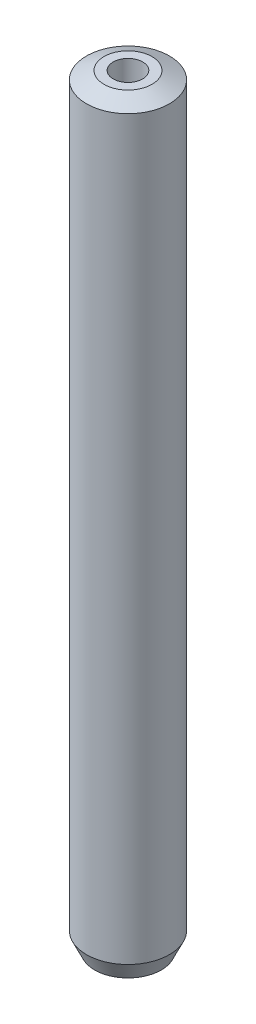
ISO-10303-21;
HEADER;
FILE_DESCRIPTION(('STEP AP214'),'2;1');
FILE_NAME('part.step','',(''),(''),'','','');
FILE_SCHEMA(('AUTOMOTIVE_DESIGN { 1 0 10303 214 1 1 1 1 }'));
ENDSEC;
DATA;
#1=APPLICATION_CONTEXT('core data for automotive mechanical design processes');
#2=APPLICATION_PROTOCOL_DEFINITION('international standard','automotive_design',2000,#1);
#3=PRODUCT_CONTEXT('',#1,'mechanical');
#4=PRODUCT('Part','Part','',(#3));
#5=PRODUCT_RELATED_PRODUCT_CATEGORY('part','',(#4));
#6=PRODUCT_DEFINITION_FORMATION('','',#4);
#7=PRODUCT_DEFINITION_CONTEXT('part definition',#1,'design');
#8=PRODUCT_DEFINITION('design','',#6,#7);
#9=PRODUCT_DEFINITION_SHAPE('','',#8);
#10=(LENGTH_UNIT() NAMED_UNIT(*) SI_UNIT(.MILLI.,.METRE.));
#11=(NAMED_UNIT(*) PLANE_ANGLE_UNIT() SI_UNIT($,.RADIAN.));
#12=(NAMED_UNIT(*) SI_UNIT($,.STERADIAN.) SOLID_ANGLE_UNIT());
#13=UNCERTAINTY_MEASURE_WITH_UNIT(LENGTH_MEASURE(1.E-05),#10,'distance_accuracy_value','');
#14=(GEOMETRIC_REPRESENTATION_CONTEXT(3) GLOBAL_UNCERTAINTY_ASSIGNED_CONTEXT((#13)) GLOBAL_UNIT_ASSIGNED_CONTEXT((#10,
#11,#12)) REPRESENTATION_CONTEXT('',''));
#15=CARTESIAN_POINT('',(0.,0.,0.));
#16=DIRECTION('',(0.,0.,1.));
#17=DIRECTION('',(1.,0.,0.));
#18=AXIS2_PLACEMENT_3D('',#15,#16,#17);
#19=CARTESIAN_POINT('',(0.,137.877778649111,0.));
#20=DIRECTION('',(0.,-1.,0.));
#21=DIRECTION('',(0.,0.,-1.));
#22=AXIS2_PLACEMENT_3D('',#19,#20,#21);
#23=CYLINDRICAL_SURFACE('',#22,7.5);
#24=CARTESIAN_POINT('',(0.,136.40398296129,0.));
#25=DIRECTION('',(0.,1.,0.));
#26=DIRECTION('',(0.,0.,1.));
#27=AXIS2_PLACEMENT_3D('',#24,#25,#26);
#28=CIRCLE('',#27,7.5);
#29=CARTESIAN_POINT('',(0.,136.40398296129,7.5));
#30=VERTEX_POINT('',#29);
#31=EDGE_CURVE('E50',#30,#30,#28,.F.);
#32=ORIENTED_EDGE('',*,*,#31,.T.);
#33=EDGE_LOOP('',(#32));
#34=FACE_BOUND('',#33,.T.);
#35=CARTESIAN_POINT('',(0.,3.15283699319915,0.));
#36=DIRECTION('',(0.,1.,0.));
#37=DIRECTION('',(0.,0.,1.));
#38=AXIS2_PLACEMENT_3D('',#35,#36,#37);
#39=CIRCLE('',#38,7.5);
#40=CARTESIAN_POINT('',(0.,3.15283699319915,7.5));
#41=VERTEX_POINT('',#40);
#42=EDGE_CURVE('E51',#41,#41,#39,.T.);
#43=ORIENTED_EDGE('',*,*,#42,.T.);
#44=EDGE_LOOP('',(#43));
#45=FACE_BOUND('',#44,.T.);
#46=ADVANCED_FACE('F39',(#34,#45),#23,.T.);
#47=CARTESIAN_POINT('',(0.,137.877778649111,0.));
#48=DIRECTION('',(0.,1.,0.));
#49=DIRECTION('',(0.,0.,1.));
#50=AXIS2_PLACEMENT_3D('',#47,#48,#49);
#51=PLANE('',#50);
#52=CARTESIAN_POINT('',(0.,137.877778649111,0.));
#53=DIRECTION('',(0.,1.,0.));
#54=DIRECTION('',(0.,0.,1.));
#55=AXIS2_PLACEMENT_3D('',#52,#53,#54);
#56=CIRCLE('',#55,4.34716300680077);
#57=CARTESIAN_POINT('',(0.,137.877778649111,4.34716300680077));
#58=VERTEX_POINT('',#57);
#59=EDGE_CURVE('E54',#58,#58,#56,.T.);
#60=ORIENTED_EDGE('',*,*,#59,.T.);
#61=EDGE_LOOP('',(#60));
#62=FACE_BOUND('',#61,.T.);
#63=CARTESIAN_POINT('',(0.,137.877778649111,0.));
#64=DIRECTION('',(0.,1.,0.));
#65=DIRECTION('',(0.,0.,1.));
#66=AXIS2_PLACEMENT_3D('',#63,#64,#65);
#67=CIRCLE('',#66,2.66725255476944);
#68=CARTESIAN_POINT('',(0.,137.877778649111,2.66725255476944));
#69=VERTEX_POINT('',#68);
#70=EDGE_CURVE('E58',#69,#69,#67,.T.);
#71=ORIENTED_EDGE('',*,*,#70,.F.);
#72=EDGE_LOOP('',(#71));
#73=FACE_BOUND('',#72,.T.);
#74=ADVANCED_FACE('F69',(#62,#73),#51,.T.);
#75=CARTESIAN_POINT('',(0.,0.,0.));
#76=DIRECTION('',(0.,1.,0.));
#77=DIRECTION('',(0.,0.,1.));
#78=AXIS2_PLACEMENT_3D('',#75,#76,#77);
#79=PLANE('',#78);
#80=CARTESIAN_POINT('',(0.,0.,0.));
#81=DIRECTION('',(0.,1.,0.));
#82=DIRECTION('',(0.,0.,1.));
#83=AXIS2_PLACEMENT_3D('',#80,#81,#82);
#84=CIRCLE('',#83,6.02620431217917);
#85=CARTESIAN_POINT('',(0.,0.,6.02620431217917));
#86=VERTEX_POINT('',#85);
#87=EDGE_CURVE('E10',#86,#86,#84,.F.);
#88=ORIENTED_EDGE('',*,*,#87,.T.);
#89=EDGE_LOOP('',(#88));
#90=FACE_BOUND('',#89,.T.);
#91=CARTESIAN_POINT('',(0.,0.,0.));
#92=DIRECTION('',(0.,1.,0.));
#93=DIRECTION('',(0.,0.,1.));
#94=AXIS2_PLACEMENT_3D('',#91,#92,#93);
#95=CIRCLE('',#94,2.66725255476944);
#96=CARTESIAN_POINT('',(0.,0.,2.66725255476944));
#97=VERTEX_POINT('',#96);
#98=EDGE_CURVE('E63',#97,#97,#95,.T.);
#99=ORIENTED_EDGE('',*,*,#98,.T.);
#100=EDGE_LOOP('',(#99));
#101=FACE_BOUND('',#100,.T.);
#102=ADVANCED_FACE('F75',(#90,#101),#79,.F.);
#103=CARTESIAN_POINT('',(0.,137.877778649111,0.));
#104=DIRECTION('',(0.,-1.,0.));
#105=DIRECTION('',(0.,0.,-1.));
#106=AXIS2_PLACEMENT_3D('',#103,#104,#105);
#107=CYLINDRICAL_SURFACE('',#106,2.66725255476944);
#108=ORIENTED_EDGE('',*,*,#70,.T.);
#109=EDGE_LOOP('',(#108));
#110=FACE_BOUND('',#109,.T.);
#111=ORIENTED_EDGE('',*,*,#98,.F.);
#112=EDGE_LOOP('',(#111));
#113=FACE_BOUND('',#112,.T.);
#114=ADVANCED_FACE('F70',(#110,#113),#107,.F.);
#115=CARTESIAN_POINT('',(0.,137.877778649111,0.));
#116=DIRECTION('',(0.,-1.,0.));
#117=DIRECTION('',(0.,0.,-1.));
#118=AXIS2_PLACEMENT_3D('',#115,#116,#117);
#119=CONICAL_SURFACE('',#118,4.34716300680077,1.13352558213287);
#120=ORIENTED_EDGE('',*,*,#31,.F.);
#121=EDGE_LOOP('',(#120));
#122=FACE_BOUND('',#121,.T.);
#123=ORIENTED_EDGE('',*,*,#59,.F.);
#124=EDGE_LOOP('',(#123));
#125=FACE_BOUND('',#124,.T.);
#126=ADVANCED_FACE('F81',(#122,#125),#119,.T.);
#127=CARTESIAN_POINT('',(0.,3.15283699319915,0.));
#128=DIRECTION('',(0.,1.,0.));
#129=DIRECTION('',(0.,0.,1.));
#130=AXIS2_PLACEMENT_3D('',#127,#128,#129);
#131=CONICAL_SURFACE('',#130,7.5,0.437270744662023);
#132=ORIENTED_EDGE('',*,*,#87,.F.);
#133=EDGE_LOOP('',(#132));
#134=FACE_BOUND('',#133,.T.);
#135=ORIENTED_EDGE('',*,*,#42,.F.);
#136=EDGE_LOOP('',(#135));
#137=FACE_BOUND('',#136,.T.);
#138=ADVANCED_FACE('F45',(#134,#137),#131,.T.);
#139=CLOSED_SHELL('',(#46,#74,#102,#114,#126,#138));
#140=MANIFOLD_SOLID_BREP('B2',#139);
#141=ADVANCED_BREP_SHAPE_REPRESENTATION('',(#18,#140),#14);
#142=SHAPE_DEFINITION_REPRESENTATION(#9,#141);
ENDSEC;
END-ISO-10303-21;
